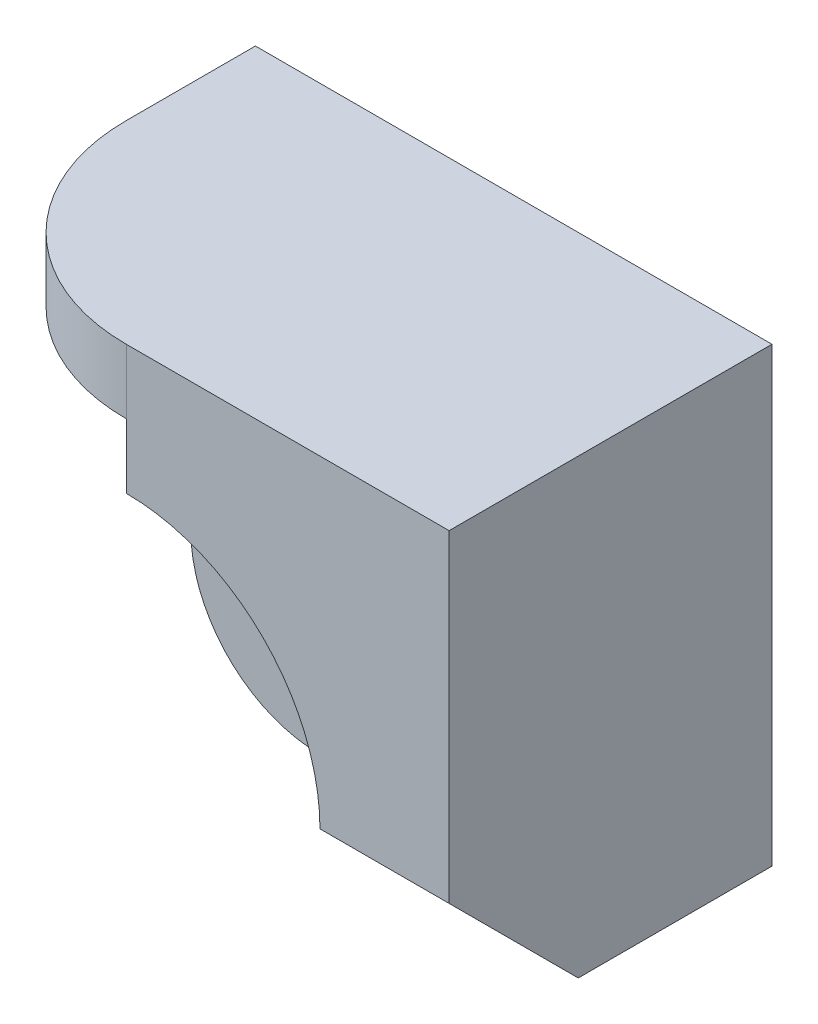
ISO-10303-21;
HEADER;
FILE_DESCRIPTION(('STEP AP214'),'2;1');
FILE_NAME('part.step','',(''),(''),'','','');
FILE_SCHEMA(('AUTOMOTIVE_DESIGN { 1 0 10303 214 1 1 1 1 }'));
ENDSEC;
DATA;
#1=APPLICATION_CONTEXT('core data for automotive mechanical design processes');
#2=APPLICATION_PROTOCOL_DEFINITION('international standard','automotive_design',2000,#1);
#3=PRODUCT_CONTEXT('',#1,'mechanical');
#4=PRODUCT('Part','Part','',(#3));
#5=PRODUCT_RELATED_PRODUCT_CATEGORY('part','',(#4));
#6=PRODUCT_DEFINITION_FORMATION('','',#4);
#7=PRODUCT_DEFINITION_CONTEXT('part definition',#1,'design');
#8=PRODUCT_DEFINITION('design','',#6,#7);
#9=PRODUCT_DEFINITION_SHAPE('','',#8);
#10=(LENGTH_UNIT() NAMED_UNIT(*) SI_UNIT(.MILLI.,.METRE.));
#11=(NAMED_UNIT(*) PLANE_ANGLE_UNIT() SI_UNIT($,.RADIAN.));
#12=(NAMED_UNIT(*) SI_UNIT($,.STERADIAN.) SOLID_ANGLE_UNIT());
#13=UNCERTAINTY_MEASURE_WITH_UNIT(LENGTH_MEASURE(1.E-05),#10,'distance_accuracy_value','');
#14=(GEOMETRIC_REPRESENTATION_CONTEXT(3) GLOBAL_UNCERTAINTY_ASSIGNED_CONTEXT((#13)) GLOBAL_UNIT_ASSIGNED_CONTEXT((#10,
#11,#12)) REPRESENTATION_CONTEXT('',''));
#15=CARTESIAN_POINT('',(0.,0.,0.));
#16=DIRECTION('',(0.,0.,1.));
#17=DIRECTION('',(1.,0.,0.));
#18=AXIS2_PLACEMENT_3D('',#15,#16,#17);
#19=CARTESIAN_POINT('',(0.,0.,5.));
#20=DIRECTION('',(0.,0.,1.));
#21=DIRECTION('',(1.,0.,0.));
#22=AXIS2_PLACEMENT_3D('',#19,#20,#21);
#23=PLANE('',#22);
#24=DIRECTION('',(-1.,0.,0.));
#25=VECTOR('',#24,1.);
#26=CARTESIAN_POINT('',(5.,0.,5.));
#27=LINE('',#26,#25);
#28=CARTESIAN_POINT('',(5.,0.,5.));
#29=VERTEX_POINT('',#28);
#30=CARTESIAN_POINT('',(3.,0.,5.));
#31=VERTEX_POINT('',#30);
#32=EDGE_CURVE('E245',#29,#31,#27,.T.);
#33=ORIENTED_EDGE('',*,*,#32,.F.);
#34=DIRECTION('',(0.,1.,0.));
#35=VECTOR('',#34,1.);
#36=CARTESIAN_POINT('',(5.,5.,5.));
#37=LINE('',#36,#35);
#38=CARTESIAN_POINT('',(5.,5.,5.));
#39=VERTEX_POINT('',#38);
#40=EDGE_CURVE('E58',#29,#39,#37,.T.);
#41=ORIENTED_EDGE('',*,*,#40,.T.);
#42=DIRECTION('',(-1.,0.,0.));
#43=VECTOR('',#42,1.);
#44=CARTESIAN_POINT('',(-3.,5.,5.));
#45=LINE('',#44,#43);
#46=CARTESIAN_POINT('',(0.,5.,5.));
#47=VERTEX_POINT('',#46);
#48=EDGE_CURVE('E116',#39,#47,#45,.T.);
#49=ORIENTED_EDGE('',*,*,#48,.T.);
#50=DIRECTION('',(0.,-1.,0.));
#51=VECTOR('',#50,1.);
#52=CARTESIAN_POINT('',(0.,7.,5.));
#53=LINE('',#52,#51);
#54=CARTESIAN_POINT('',(0.,4.,5.));
#55=VERTEX_POINT('',#54);
#56=EDGE_CURVE('E238',#47,#55,#53,.T.);
#57=ORIENTED_EDGE('',*,*,#56,.T.);
#58=DIRECTION('',(0.,-1.,0.));
#59=VECTOR('',#58,1.);
#60=CARTESIAN_POINT('',(0.,4.,5.));
#61=LINE('',#60,#59);
#62=CARTESIAN_POINT('',(0.,3.,5.));
#63=VERTEX_POINT('',#62);
#64=EDGE_CURVE('E225',#55,#63,#61,.T.);
#65=ORIENTED_EDGE('',*,*,#64,.T.);
#66=CARTESIAN_POINT('',(0.,0.,5.));
#67=DIRECTION('',(0.,0.,-1.));
#68=DIRECTION('',(-1.,0.,0.));
#69=AXIS2_PLACEMENT_3D('',#66,#67,#68);
#70=CIRCLE('',#69,3.00000000000002);
#71=EDGE_CURVE('E221',#63,#31,#70,.T.);
#72=ORIENTED_EDGE('',*,*,#71,.T.);
#73=EDGE_LOOP('',(#33,#41,#49,#57,#65,#72));
#74=FACE_BOUND('',#73,.T.);
#75=ADVANCED_FACE('F33',(#74),#23,.T.);
#76=CARTESIAN_POINT('',(0.,0.,5.));
#77=DIRECTION('',(0.,0.,-1.));
#78=DIRECTION('',(-1.,0.,0.));
#79=AXIS2_PLACEMENT_3D('',#76,#77,#78);
#80=CYLINDRICAL_SURFACE('',#79,2.);
#81=CARTESIAN_POINT('',(0.,0.,2.));
#82=DIRECTION('',(0.,0.,1.));
#83=DIRECTION('',(1.,0.,0.));
#84=AXIS2_PLACEMENT_3D('',#81,#82,#83);
#85=CIRCLE('',#84,2.);
#86=CARTESIAN_POINT('',(-2.,0.,2.));
#87=VERTEX_POINT('',#86);
#88=CARTESIAN_POINT('',(0.,-2.,2.));
#89=VERTEX_POINT('',#88);
#90=EDGE_CURVE('E195',#87,#89,#85,.T.);
#91=ORIENTED_EDGE('',*,*,#90,.F.);
#92=DIRECTION('',(0.,0.,-1.));
#93=VECTOR('',#92,1.);
#94=CARTESIAN_POINT('',(-2.,0.,5.));
#95=LINE('',#94,#93);
#96=CARTESIAN_POINT('',(-2.,0.,0.));
#97=VERTEX_POINT('',#96);
#98=EDGE_CURVE('E98',#87,#97,#95,.T.);
#99=ORIENTED_EDGE('',*,*,#98,.T.);
#100=CARTESIAN_POINT('',(0.,0.,0.));
#101=DIRECTION('',(0.,0.,1.));
#102=DIRECTION('',(1.,0.,0.));
#103=AXIS2_PLACEMENT_3D('',#100,#101,#102);
#104=CIRCLE('',#103,2.);
#105=CARTESIAN_POINT('',(0.,-2.,0.));
#106=VERTEX_POINT('',#105);
#107=EDGE_CURVE('E114',#97,#106,#104,.T.);
#108=ORIENTED_EDGE('',*,*,#107,.T.);
#109=DIRECTION('',(0.,0.,-1.));
#110=VECTOR('',#109,1.);
#111=CARTESIAN_POINT('',(0.,-2.,5.));
#112=LINE('',#111,#110);
#113=EDGE_CURVE('E12',#89,#106,#112,.T.);
#114=ORIENTED_EDGE('',*,*,#113,.F.);
#115=EDGE_LOOP('',(#91,#99,#108,#114));
#116=FACE_BOUND('',#115,.T.);
#117=ADVANCED_FACE('F35',(#116),#80,.T.);
#118=CARTESIAN_POINT('',(-2.,0.,5.));
#119=DIRECTION('',(1.,0.,0.));
#120=DIRECTION('',(0.,0.,-1.));
#121=AXIS2_PLACEMENT_3D('',#118,#119,#120);
#122=PLANE('',#121);
#123=DIRECTION('',(0.,-1.,0.));
#124=VECTOR('',#123,1.);
#125=CARTESIAN_POINT('',(-2.,0.,2.));
#126=LINE('',#125,#124);
#127=CARTESIAN_POINT('',(-2.,4.,2.));
#128=VERTEX_POINT('',#127);
#129=EDGE_CURVE('E94',#128,#87,#126,.T.);
#130=ORIENTED_EDGE('',*,*,#129,.F.);
#131=DIRECTION('',(0.,0.,-1.));
#132=VECTOR('',#131,1.);
#133=CARTESIAN_POINT('',(-2.,4.,5.));
#134=LINE('',#133,#132);
#135=CARTESIAN_POINT('',(-2.,4.,0.));
#136=VERTEX_POINT('',#135);
#137=EDGE_CURVE('E85',#128,#136,#134,.T.);
#138=ORIENTED_EDGE('',*,*,#137,.T.);
#139=DIRECTION('',(0.,-1.,0.));
#140=VECTOR('',#139,1.);
#141=CARTESIAN_POINT('',(-2.,0.,0.));
#142=LINE('',#141,#140);
#143=EDGE_CURVE('E90',#136,#97,#142,.T.);
#144=ORIENTED_EDGE('',*,*,#143,.T.);
#145=ORIENTED_EDGE('',*,*,#98,.F.);
#146=EDGE_LOOP('',(#130,#138,#144,#145));
#147=FACE_BOUND('',#146,.T.);
#148=ADVANCED_FACE('F87',(#147),#122,.F.);
#149=CARTESIAN_POINT('',(0.,0.,5.));
#150=DIRECTION('',(0.,0.,-1.));
#151=DIRECTION('',(-1.,0.,0.));
#152=AXIS2_PLACEMENT_3D('',#149,#150,#151);
#153=CYLINDRICAL_SURFACE('',#152,1.);
#154=CARTESIAN_POINT('',(0.,0.,0.));
#155=DIRECTION('',(0.,0.,1.));
#156=DIRECTION('',(1.,0.,0.));
#157=AXIS2_PLACEMENT_3D('',#154,#155,#156);
#158=CIRCLE('',#157,1.);
#159=CARTESIAN_POINT('',(1.,0.,0.));
#160=VERTEX_POINT('',#159);
#161=EDGE_CURVE('E205',#160,#160,#158,.T.);
#162=ORIENTED_EDGE('',*,*,#161,.F.);
#163=EDGE_LOOP('',(#162));
#164=FACE_BOUND('',#163,.T.);
#165=CARTESIAN_POINT('',(0.,0.,2.));
#166=DIRECTION('',(0.,0.,1.));
#167=DIRECTION('',(1.,0.,0.));
#168=AXIS2_PLACEMENT_3D('',#165,#166,#167);
#169=CIRCLE('',#168,1.);
#170=CARTESIAN_POINT('',(1.,0.,2.));
#171=VERTEX_POINT('',#170);
#172=EDGE_CURVE('E37',#171,#171,#169,.T.);
#173=ORIENTED_EDGE('',*,*,#172,.T.);
#174=EDGE_LOOP('',(#173));
#175=FACE_BOUND('',#174,.T.);
#176=ADVANCED_FACE('F271',(#164,#175),#153,.F.);
#177=CARTESIAN_POINT('',(0.,0.,0.));
#178=DIRECTION('',(0.,0.,1.));
#179=DIRECTION('',(1.,0.,0.));
#180=AXIS2_PLACEMENT_3D('',#177,#178,#179);
#181=PLANE('',#180);
#182=ORIENTED_EDGE('',*,*,#107,.F.);
#183=ORIENTED_EDGE('',*,*,#143,.F.);
#184=DIRECTION('',(1.,0.,0.));
#185=VECTOR('',#184,1.);
#186=CARTESIAN_POINT('',(-2.,4.,0.));
#187=LINE('',#186,#185);
#188=CARTESIAN_POINT('',(-3.,4.,0.));
#189=VERTEX_POINT('',#188);
#190=EDGE_CURVE('E101',#189,#136,#187,.T.);
#191=ORIENTED_EDGE('',*,*,#190,.F.);
#192=DIRECTION('',(0.,-1.,0.));
#193=VECTOR('',#192,1.);
#194=CARTESIAN_POINT('',(-3.,4.,0.));
#195=LINE('',#194,#193);
#196=CARTESIAN_POINT('',(-3.,5.,0.));
#197=VERTEX_POINT('',#196);
#198=EDGE_CURVE('E108',#197,#189,#195,.T.);
#199=ORIENTED_EDGE('',*,*,#198,.F.);
#200=DIRECTION('',(-1.,0.,0.));
#201=VECTOR('',#200,1.);
#202=CARTESIAN_POINT('',(-3.,5.,0.));
#203=LINE('',#202,#201);
#204=CARTESIAN_POINT('',(5.,5.,0.));
#205=VERTEX_POINT('',#204);
#206=EDGE_CURVE('E146',#205,#197,#203,.T.);
#207=ORIENTED_EDGE('',*,*,#206,.F.);
#208=DIRECTION('',(0.,1.,0.));
#209=VECTOR('',#208,1.);
#210=CARTESIAN_POINT('',(5.,5.,0.));
#211=LINE('',#210,#209);
#212=CARTESIAN_POINT('',(5.,-2.,0.));
#213=VERTEX_POINT('',#212);
#214=EDGE_CURVE('E133',#213,#205,#211,.T.);
#215=ORIENTED_EDGE('',*,*,#214,.F.);
#216=DIRECTION('',(1.,0.,0.));
#217=VECTOR('',#216,1.);
#218=CARTESIAN_POINT('',(5.,-2.,0.));
#219=LINE('',#218,#217);
#220=EDGE_CURVE('E140',#106,#213,#219,.T.);
#221=ORIENTED_EDGE('',*,*,#220,.F.);
#222=EDGE_LOOP('',(#182,#183,#191,#199,#207,#215,#221));
#223=FACE_BOUND('',#222,.T.);
#224=ORIENTED_EDGE('',*,*,#161,.T.);
#225=EDGE_LOOP('',(#224));
#226=FACE_BOUND('',#225,.T.);
#227=ADVANCED_FACE('F110',(#223,#226),#181,.F.);
#228=CARTESIAN_POINT('',(5.,-2.,5.));
#229=DIRECTION('',(0.,1.,0.));
#230=DIRECTION('',(0.,0.,1.));
#231=AXIS2_PLACEMENT_3D('',#228,#229,#230);
#232=PLANE('',#231);
#233=DIRECTION('',(0.,0.,-1.));
#234=VECTOR('',#233,1.);
#235=CARTESIAN_POINT('',(5.,-2.,5.));
#236=LINE('',#235,#234);
#237=CARTESIAN_POINT('',(5.,-2.,3.));
#238=VERTEX_POINT('',#237);
#239=EDGE_CURVE('E42',#238,#213,#236,.T.);
#240=ORIENTED_EDGE('',*,*,#239,.F.);
#241=DIRECTION('',(-1.,0.,0.));
#242=VECTOR('',#241,1.);
#243=CARTESIAN_POINT('',(5.,-2.,3.));
#244=LINE('',#243,#242);
#245=CARTESIAN_POINT('',(3.,-2.,3.));
#246=VERTEX_POINT('',#245);
#247=EDGE_CURVE('E244',#238,#246,#244,.T.);
#248=ORIENTED_EDGE('',*,*,#247,.T.);
#249=DIRECTION('',(0.,0.,1.));
#250=VECTOR('',#249,1.);
#251=CARTESIAN_POINT('',(3.,-2.,2.));
#252=LINE('',#251,#250);
#253=CARTESIAN_POINT('',(3.,-2.,2.));
#254=VERTEX_POINT('',#253);
#255=EDGE_CURVE('E204',#254,#246,#252,.T.);
#256=ORIENTED_EDGE('',*,*,#255,.F.);
#257=DIRECTION('',(1.,0.,0.));
#258=VECTOR('',#257,1.);
#259=CARTESIAN_POINT('',(5.,-2.,2.));
#260=LINE('',#259,#258);
#261=EDGE_CURVE('E198',#89,#254,#260,.T.);
#262=ORIENTED_EDGE('',*,*,#261,.F.);
#263=ORIENTED_EDGE('',*,*,#113,.T.);
#264=ORIENTED_EDGE('',*,*,#220,.T.);
#265=EDGE_LOOP('',(#240,#248,#256,#262,#263,#264));
#266=FACE_BOUND('',#265,.T.);
#267=ADVANCED_FACE('F141',(#266),#232,.F.);
#268=CARTESIAN_POINT('',(5.,5.,5.));
#269=DIRECTION('',(-1.,0.,0.));
#270=DIRECTION('',(0.,-1.,0.));
#271=AXIS2_PLACEMENT_3D('',#268,#269,#270);
#272=PLANE('',#271);
#273=ORIENTED_EDGE('',*,*,#40,.F.);
#274=DIRECTION('',(0.,-0.707106781186548,-0.707106781186548));
#275=VECTOR('',#274,1.);
#276=CARTESIAN_POINT('',(5.,0.,5.));
#277=LINE('',#276,#275);
#278=EDGE_CURVE('E137',#29,#238,#277,.T.);
#279=ORIENTED_EDGE('',*,*,#278,.T.);
#280=ORIENTED_EDGE('',*,*,#239,.T.);
#281=ORIENTED_EDGE('',*,*,#214,.T.);
#282=DIRECTION('',(0.,0.,-1.));
#283=VECTOR('',#282,1.);
#284=CARTESIAN_POINT('',(5.,5.,5.));
#285=LINE('',#284,#283);
#286=EDGE_CURVE('E124',#39,#205,#285,.T.);
#287=ORIENTED_EDGE('',*,*,#286,.F.);
#288=EDGE_LOOP('',(#273,#279,#280,#281,#287));
#289=FACE_BOUND('',#288,.T.);
#290=ADVANCED_FACE('F131',(#289),#272,.F.);
#291=CARTESIAN_POINT('',(-3.,5.,5.));
#292=DIRECTION('',(0.,-1.,0.));
#293=DIRECTION('',(0.,0.,-1.));
#294=AXIS2_PLACEMENT_3D('',#291,#292,#293);
#295=PLANE('',#294);
#296=DIRECTION('',(0.,0.,-1.));
#297=VECTOR('',#296,1.);
#298=CARTESIAN_POINT('',(-3.,5.,5.));
#299=LINE('',#298,#297);
#300=CARTESIAN_POINT('',(-3.,5.,2.));
#301=VERTEX_POINT('',#300);
#302=EDGE_CURVE('E122',#301,#197,#299,.T.);
#303=ORIENTED_EDGE('',*,*,#302,.F.);
#304=CARTESIAN_POINT('',(0.,5.,2.));
#305=DIRECTION('',(0.,-1.,0.));
#306=DIRECTION('',(0.,0.,-1.));
#307=AXIS2_PLACEMENT_3D('',#304,#305,#306);
#308=CIRCLE('',#307,3.);
#309=EDGE_CURVE('E228',#301,#47,#308,.F.);
#310=ORIENTED_EDGE('',*,*,#309,.T.);
#311=ORIENTED_EDGE('',*,*,#48,.F.);
#312=ORIENTED_EDGE('',*,*,#286,.T.);
#313=ORIENTED_EDGE('',*,*,#206,.T.);
#314=EDGE_LOOP('',(#303,#310,#311,#312,#313));
#315=FACE_BOUND('',#314,.T.);
#316=ADVANCED_FACE('F156',(#315),#295,.F.);
#317=CARTESIAN_POINT('',(-3.,4.,5.));
#318=DIRECTION('',(1.,0.,0.));
#319=DIRECTION('',(0.,0.,-1.));
#320=AXIS2_PLACEMENT_3D('',#317,#318,#319);
#321=PLANE('',#320);
#322=DIRECTION('',(0.,0.,-1.));
#323=VECTOR('',#322,1.);
#324=CARTESIAN_POINT('',(-3.,4.,5.));
#325=LINE('',#324,#323);
#326=CARTESIAN_POINT('',(-3.,4.,2.));
#327=VERTEX_POINT('',#326);
#328=EDGE_CURVE('E97',#327,#189,#325,.T.);
#329=ORIENTED_EDGE('',*,*,#328,.F.);
#330=DIRECTION('',(0.,-1.,0.));
#331=VECTOR('',#330,1.);
#332=CARTESIAN_POINT('',(-3.,7.,2.));
#333=LINE('',#332,#331);
#334=EDGE_CURVE('E49',#301,#327,#333,.T.);
#335=ORIENTED_EDGE('',*,*,#334,.F.);
#336=ORIENTED_EDGE('',*,*,#302,.T.);
#337=ORIENTED_EDGE('',*,*,#198,.T.);
#338=EDGE_LOOP('',(#329,#335,#336,#337));
#339=FACE_BOUND('',#338,.T.);
#340=ADVANCED_FACE('F151',(#339),#321,.F.);
#341=CARTESIAN_POINT('',(-2.,4.,5.));
#342=DIRECTION('',(0.,1.,0.));
#343=DIRECTION('',(0.,0.,1.));
#344=AXIS2_PLACEMENT_3D('',#341,#342,#343);
#345=PLANE('',#344);
#346=DIRECTION('',(0.,0.,1.));
#347=VECTOR('',#346,1.);
#348=CARTESIAN_POINT('',(0.,4.,2.));
#349=LINE('',#348,#347);
#350=CARTESIAN_POINT('',(0.,4.,2.));
#351=VERTEX_POINT('',#350);
#352=EDGE_CURVE('E212',#351,#55,#349,.T.);
#353=ORIENTED_EDGE('',*,*,#352,.T.);
#354=CARTESIAN_POINT('',(0.,4.,2.));
#355=DIRECTION('',(0.,1.,0.));
#356=DIRECTION('',(0.,0.,-1.));
#357=AXIS2_PLACEMENT_3D('',#354,#355,#356);
#358=CIRCLE('',#357,3.);
#359=EDGE_CURVE('E241',#327,#55,#358,.T.);
#360=ORIENTED_EDGE('',*,*,#359,.F.);
#361=ORIENTED_EDGE('',*,*,#328,.T.);
#362=ORIENTED_EDGE('',*,*,#190,.T.);
#363=ORIENTED_EDGE('',*,*,#137,.F.);
#364=DIRECTION('',(1.,0.,0.));
#365=VECTOR('',#364,1.);
#366=CARTESIAN_POINT('',(-3.,4.,2.));
#367=LINE('',#366,#365);
#368=EDGE_CURVE('E224',#128,#351,#367,.T.);
#369=ORIENTED_EDGE('',*,*,#368,.T.);
#370=EDGE_LOOP('',(#353,#360,#361,#362,#363,#369));
#371=FACE_BOUND('',#370,.T.);
#372=ADVANCED_FACE('F103',(#371),#345,.F.);
#373=CARTESIAN_POINT('',(1.,1.5,2.));
#374=DIRECTION('',(0.,0.,1.));
#375=DIRECTION('',(1.,0.,0.));
#376=AXIS2_PLACEMENT_3D('',#373,#374,#375);
#377=PLANE('',#376);
#378=ORIENTED_EDGE('',*,*,#172,.F.);
#379=EDGE_LOOP('',(#378));
#380=FACE_BOUND('',#379,.T.);
#381=ORIENTED_EDGE('',*,*,#261,.T.);
#382=DIRECTION('',(0.,-1.,0.));
#383=VECTOR('',#382,1.);
#384=CARTESIAN_POINT('',(3.,-2.,2.));
#385=LINE('',#384,#383);
#386=CARTESIAN_POINT('',(3.,0.,2.));
#387=VERTEX_POINT('',#386);
#388=EDGE_CURVE('E215',#387,#254,#385,.T.);
#389=ORIENTED_EDGE('',*,*,#388,.F.);
#390=CARTESIAN_POINT('',(0.,0.,2.));
#391=DIRECTION('',(0.,0.,-1.));
#392=DIRECTION('',(-1.,0.,0.));
#393=AXIS2_PLACEMENT_3D('',#390,#391,#392);
#394=CIRCLE('',#393,3.00000000000002);
#395=CARTESIAN_POINT('',(0.,3.,2.));
#396=VERTEX_POINT('',#395);
#397=EDGE_CURVE('E230',#396,#387,#394,.T.);
#398=ORIENTED_EDGE('',*,*,#397,.F.);
#399=DIRECTION('',(0.,-1.,0.));
#400=VECTOR('',#399,1.);
#401=CARTESIAN_POINT('',(0.,4.,2.));
#402=LINE('',#401,#400);
#403=EDGE_CURVE('E233',#351,#396,#402,.T.);
#404=ORIENTED_EDGE('',*,*,#403,.F.);
#405=ORIENTED_EDGE('',*,*,#368,.F.);
#406=ORIENTED_EDGE('',*,*,#129,.T.);
#407=ORIENTED_EDGE('',*,*,#90,.T.);
#408=EDGE_LOOP('',(#381,#389,#398,#404,#405,#406,#407));
#409=FACE_BOUND('',#408,.T.);
#410=ADVANCED_FACE('F196',(#380,#409),#377,.T.);
#411=CARTESIAN_POINT('',(3.,-2.,2.));
#412=DIRECTION('',(-1.,0.,0.));
#413=DIRECTION('',(0.,0.,1.));
#414=AXIS2_PLACEMENT_3D('',#411,#412,#413);
#415=PLANE('',#414);
#416=DIRECTION('',(0.,-0.707106781186548,-0.707106781186548));
#417=VECTOR('',#416,1.);
#418=CARTESIAN_POINT('',(3.,0.,5.));
#419=LINE('',#418,#417);
#420=EDGE_CURVE('E248',#31,#246,#419,.T.);
#421=ORIENTED_EDGE('',*,*,#420,.F.);
#422=DIRECTION('',(0.,0.,1.));
#423=VECTOR('',#422,1.);
#424=CARTESIAN_POINT('',(3.,0.,2.));
#425=LINE('',#424,#423);
#426=EDGE_CURVE('E217',#387,#31,#425,.T.);
#427=ORIENTED_EDGE('',*,*,#426,.F.);
#428=ORIENTED_EDGE('',*,*,#388,.T.);
#429=ORIENTED_EDGE('',*,*,#255,.T.);
#430=EDGE_LOOP('',(#421,#427,#428,#429));
#431=FACE_BOUND('',#430,.T.);
#432=ADVANCED_FACE('F253',(#431),#415,.T.);
#433=CARTESIAN_POINT('',(0.,0.,2.));
#434=DIRECTION('',(0.,0.,1.));
#435=DIRECTION('',(1.,0.,0.));
#436=AXIS2_PLACEMENT_3D('',#433,#434,#435);
#437=CYLINDRICAL_SURFACE('',#436,3.00000000000002);
#438=ORIENTED_EDGE('',*,*,#71,.F.);
#439=DIRECTION('',(0.,0.,1.));
#440=VECTOR('',#439,1.);
#441=CARTESIAN_POINT('',(0.,3.,2.));
#442=LINE('',#441,#440);
#443=EDGE_CURVE('E214',#396,#63,#442,.T.);
#444=ORIENTED_EDGE('',*,*,#443,.F.);
#445=ORIENTED_EDGE('',*,*,#397,.T.);
#446=ORIENTED_EDGE('',*,*,#426,.T.);
#447=EDGE_LOOP('',(#438,#444,#445,#446));
#448=FACE_BOUND('',#447,.T.);
#449=ADVANCED_FACE('F258',(#448),#437,.F.);
#450=CARTESIAN_POINT('',(0.,4.,2.));
#451=DIRECTION('',(-1.,0.,0.));
#452=DIRECTION('',(0.,-1.,0.));
#453=AXIS2_PLACEMENT_3D('',#450,#451,#452);
#454=PLANE('',#453);
#455=ORIENTED_EDGE('',*,*,#64,.F.);
#456=ORIENTED_EDGE('',*,*,#352,.F.);
#457=ORIENTED_EDGE('',*,*,#403,.T.);
#458=ORIENTED_EDGE('',*,*,#443,.T.);
#459=EDGE_LOOP('',(#455,#456,#457,#458));
#460=FACE_BOUND('',#459,.T.);
#461=ADVANCED_FACE('F261',(#460),#454,.T.);
#462=CARTESIAN_POINT('',(0.,7.,2.));
#463=DIRECTION('',(0.,-1.,0.));
#464=DIRECTION('',(0.,0.,-1.));
#465=AXIS2_PLACEMENT_3D('',#462,#463,#464);
#466=CYLINDRICAL_SURFACE('',#465,3.);
#467=ORIENTED_EDGE('',*,*,#334,.T.);
#468=ORIENTED_EDGE('',*,*,#359,.T.);
#469=ORIENTED_EDGE('',*,*,#56,.F.);
#470=ORIENTED_EDGE('',*,*,#309,.F.);
#471=EDGE_LOOP('',(#467,#468,#469,#470));
#472=FACE_BOUND('',#471,.T.);
#473=ADVANCED_FACE('F263',(#472),#466,.T.);
#474=CARTESIAN_POINT('',(5.,0.,5.));
#475=DIRECTION('',(0.,0.707106781186548,-0.707106781186547));
#476=DIRECTION('',(0.,0.707106781186547,0.707106781186548));
#477=AXIS2_PLACEMENT_3D('',#474,#475,#476);
#478=PLANE('',#477);
#479=ORIENTED_EDGE('',*,*,#420,.T.);
#480=ORIENTED_EDGE('',*,*,#247,.F.);
#481=ORIENTED_EDGE('',*,*,#278,.F.);
#482=ORIENTED_EDGE('',*,*,#32,.T.);
#483=EDGE_LOOP('',(#479,#480,#481,#482));
#484=FACE_BOUND('',#483,.T.);
#485=ADVANCED_FACE('F251',(#484),#478,.F.);
#486=CLOSED_SHELL('',(#75,#117,#148,#176,#227,#267,#290,#316,#340,#372,#410,#432,#449,#461,#473,#485));
#487=MANIFOLD_SOLID_BREP('B2',#486);
#488=ADVANCED_BREP_SHAPE_REPRESENTATION('',(#18,#487),#14);
#489=SHAPE_DEFINITION_REPRESENTATION(#9,#488);
ENDSEC;
END-ISO-10303-21;
